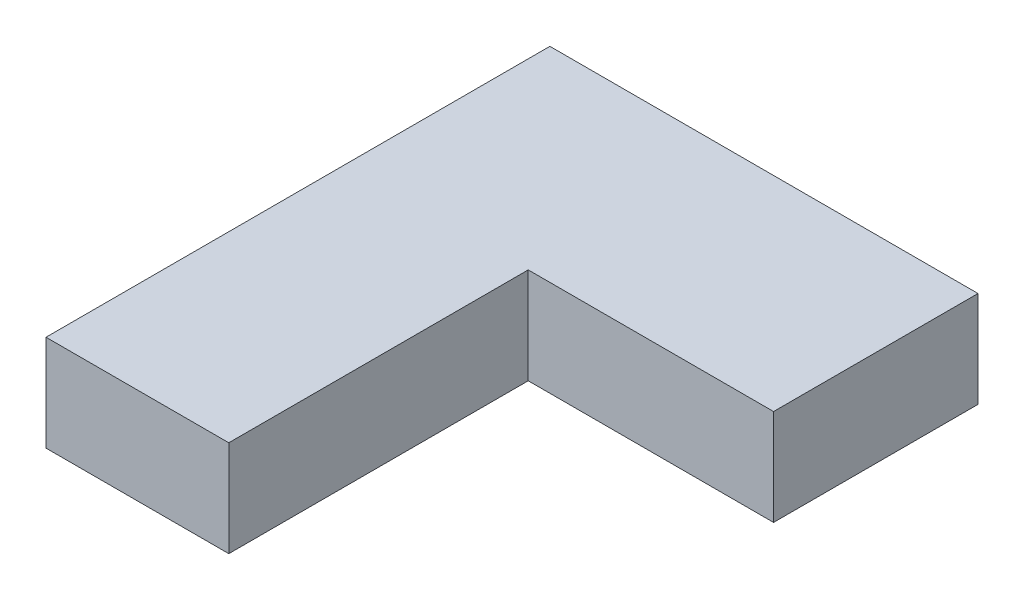
ISO-10303-21;
HEADER;
FILE_DESCRIPTION(('STEP AP214'),'2;1');
FILE_NAME('part.step','',(''),(''),'','','');
FILE_SCHEMA(('AUTOMOTIVE_DESIGN { 1 0 10303 214 1 1 1 1 }'));
ENDSEC;
DATA;
#1=APPLICATION_CONTEXT('core data for automotive mechanical design processes');
#2=APPLICATION_PROTOCOL_DEFINITION('international standard','automotive_design',2000,#1);
#3=PRODUCT_CONTEXT('',#1,'mechanical');
#4=PRODUCT('Part','Part','',(#3));
#5=PRODUCT_RELATED_PRODUCT_CATEGORY('part','',(#4));
#6=PRODUCT_DEFINITION_FORMATION('','',#4);
#7=PRODUCT_DEFINITION_CONTEXT('part definition',#1,'design');
#8=PRODUCT_DEFINITION('design','',#6,#7);
#9=PRODUCT_DEFINITION_SHAPE('','',#8);
#10=(LENGTH_UNIT() NAMED_UNIT(*) SI_UNIT(.MILLI.,.METRE.));
#11=(NAMED_UNIT(*) PLANE_ANGLE_UNIT() SI_UNIT($,.RADIAN.));
#12=(NAMED_UNIT(*) SI_UNIT($,.STERADIAN.) SOLID_ANGLE_UNIT());
#13=UNCERTAINTY_MEASURE_WITH_UNIT(LENGTH_MEASURE(1.E-05),#10,'distance_accuracy_value','');
#14=(GEOMETRIC_REPRESENTATION_CONTEXT(3) GLOBAL_UNCERTAINTY_ASSIGNED_CONTEXT((#13)) GLOBAL_UNIT_ASSIGNED_CONTEXT((#10,
#11,#12)) REPRESENTATION_CONTEXT('',''));
#15=CARTESIAN_POINT('',(0.,0.,0.));
#16=DIRECTION('',(0.,0.,1.));
#17=DIRECTION('',(1.,0.,0.));
#18=AXIS2_PLACEMENT_3D('',#15,#16,#17);
#19=CARTESIAN_POINT('',(19.0294654065861,10.,0.));
#20=DIRECTION('',(0.,0.,-1.));
#21=DIRECTION('',(-1.,0.,0.));
#22=AXIS2_PLACEMENT_3D('',#19,#20,#21);
#23=PLANE('',#22);
#24=DIRECTION('',(1.,0.,0.));
#25=VECTOR('',#24,1.);
#26=CARTESIAN_POINT('',(19.0294654065861,0.,0.));
#27=LINE('',#26,#25);
#28=CARTESIAN_POINT('',(0.,0.,0.));
#29=VERTEX_POINT('',#28);
#30=CARTESIAN_POINT('',(19.0294654065861,0.,0.));
#31=VERTEX_POINT('',#30);
#32=EDGE_CURVE('E117',#29,#31,#27,.T.);
#33=ORIENTED_EDGE('',*,*,#32,.T.);
#34=DIRECTION('',(0.,-1.,0.));
#35=VECTOR('',#34,1.);
#36=CARTESIAN_POINT('',(19.0294654065861,10.,0.));
#37=LINE('',#36,#35);
#38=CARTESIAN_POINT('',(19.0294654065861,10.,0.));
#39=VERTEX_POINT('',#38);
#40=EDGE_CURVE('E11',#39,#31,#37,.T.);
#41=ORIENTED_EDGE('',*,*,#40,.F.);
#42=DIRECTION('',(1.,0.,0.));
#43=VECTOR('',#42,1.);
#44=CARTESIAN_POINT('',(19.0294654065861,10.,0.));
#45=LINE('',#44,#43);
#46=CARTESIAN_POINT('',(0.,10.,0.));
#47=VERTEX_POINT('',#46);
#48=EDGE_CURVE('E127',#47,#39,#45,.T.);
#49=ORIENTED_EDGE('',*,*,#48,.F.);
#50=DIRECTION('',(0.,-1.,0.));
#51=VECTOR('',#50,1.);
#52=CARTESIAN_POINT('',(0.,10.,0.));
#53=LINE('',#52,#51);
#54=EDGE_CURVE('E113',#47,#29,#53,.T.);
#55=ORIENTED_EDGE('',*,*,#54,.T.);
#56=EDGE_LOOP('',(#33,#41,#49,#55));
#57=FACE_BOUND('',#56,.T.);
#58=ADVANCED_FACE('F33',(#57),#23,.F.);
#59=CARTESIAN_POINT('',(19.0294654065861,10.,-31.1732689884207));
#60=DIRECTION('',(-1.,0.,0.));
#61=DIRECTION('',(0.,0.,1.));
#62=AXIS2_PLACEMENT_3D('',#59,#60,#61);
#63=PLANE('',#62);
#64=DIRECTION('',(0.,0.,-1.));
#65=VECTOR('',#64,1.);
#66=CARTESIAN_POINT('',(19.0294654065861,0.,-31.1732689884207));
#67=LINE('',#66,#65);
#68=CARTESIAN_POINT('',(19.0294654065861,0.,-31.1732689884207));
#69=VERTEX_POINT('',#68);
#70=EDGE_CURVE('E120',#31,#69,#67,.T.);
#71=ORIENTED_EDGE('',*,*,#70,.T.);
#72=DIRECTION('',(0.,-1.,0.));
#73=VECTOR('',#72,1.);
#74=CARTESIAN_POINT('',(19.0294654065861,10.,-31.1732689884207));
#75=LINE('',#74,#73);
#76=CARTESIAN_POINT('',(19.0294654065861,10.,-31.1732689884207));
#77=VERTEX_POINT('',#76);
#78=EDGE_CURVE('E41',#77,#69,#75,.T.);
#79=ORIENTED_EDGE('',*,*,#78,.F.);
#80=DIRECTION('',(0.,0.,-1.));
#81=VECTOR('',#80,1.);
#82=CARTESIAN_POINT('',(19.0294654065861,10.,-31.1732689884207));
#83=LINE('',#82,#81);
#84=EDGE_CURVE('E86',#39,#77,#83,.T.);
#85=ORIENTED_EDGE('',*,*,#84,.F.);
#86=ORIENTED_EDGE('',*,*,#40,.T.);
#87=EDGE_LOOP('',(#71,#79,#85,#86));
#88=FACE_BOUND('',#87,.T.);
#89=ADVANCED_FACE('F151',(#88),#63,.F.);
#90=CARTESIAN_POINT('',(44.5690110838464,10.,-31.1732689884207));
#91=DIRECTION('',(0.,0.,-1.));
#92=DIRECTION('',(-1.,0.,0.));
#93=AXIS2_PLACEMENT_3D('',#90,#91,#92);
#94=PLANE('',#93);
#95=DIRECTION('',(1.,0.,0.));
#96=VECTOR('',#95,1.);
#97=CARTESIAN_POINT('',(44.5690110838464,0.,-31.1732689884207));
#98=LINE('',#97,#96);
#99=CARTESIAN_POINT('',(44.5690110838464,0.,-31.1732689884207));
#100=VERTEX_POINT('',#99);
#101=EDGE_CURVE('E122',#69,#100,#98,.T.);
#102=ORIENTED_EDGE('',*,*,#101,.T.);
#103=DIRECTION('',(0.,-1.,0.));
#104=VECTOR('',#103,1.);
#105=CARTESIAN_POINT('',(44.5690110838464,10.,-31.1732689884207));
#106=LINE('',#105,#104);
#107=CARTESIAN_POINT('',(44.5690110838464,10.,-31.1732689884207));
#108=VERTEX_POINT('',#107);
#109=EDGE_CURVE('E108',#108,#100,#106,.T.);
#110=ORIENTED_EDGE('',*,*,#109,.F.);
#111=DIRECTION('',(1.,0.,0.));
#112=VECTOR('',#111,1.);
#113=CARTESIAN_POINT('',(44.5690110838464,10.,-31.1732689884207));
#114=LINE('',#113,#112);
#115=EDGE_CURVE('E99',#77,#108,#114,.T.);
#116=ORIENTED_EDGE('',*,*,#115,.F.);
#117=ORIENTED_EDGE('',*,*,#78,.T.);
#118=EDGE_LOOP('',(#102,#110,#116,#117));
#119=FACE_BOUND('',#118,.T.);
#120=ADVANCED_FACE('F133',(#119),#94,.F.);
#121=CARTESIAN_POINT('',(44.5690110838464,10.,-52.456223719471));
#122=DIRECTION('',(-1.,0.,0.));
#123=DIRECTION('',(0.,0.,1.));
#124=AXIS2_PLACEMENT_3D('',#121,#122,#123);
#125=PLANE('',#124);
#126=DIRECTION('',(0.,0.,-1.));
#127=VECTOR('',#126,1.);
#128=CARTESIAN_POINT('',(44.5690110838464,0.,-52.456223719471));
#129=LINE('',#128,#127);
#130=CARTESIAN_POINT('',(44.5690110838464,0.,-52.456223719471));
#131=VERTEX_POINT('',#130);
#132=EDGE_CURVE('E107',#100,#131,#129,.T.);
#133=ORIENTED_EDGE('',*,*,#132,.T.);
#134=DIRECTION('',(0.,-1.,0.));
#135=VECTOR('',#134,1.);
#136=CARTESIAN_POINT('',(44.5690110838464,10.,-52.456223719471));
#137=LINE('',#136,#135);
#138=CARTESIAN_POINT('',(44.5690110838464,10.,-52.456223719471));
#139=VERTEX_POINT('',#138);
#140=EDGE_CURVE('E104',#139,#131,#137,.T.);
#141=ORIENTED_EDGE('',*,*,#140,.F.);
#142=DIRECTION('',(0.,0.,-1.));
#143=VECTOR('',#142,1.);
#144=CARTESIAN_POINT('',(44.5690110838464,10.,-52.456223719471));
#145=LINE('',#144,#143);
#146=EDGE_CURVE('E93',#108,#139,#145,.T.);
#147=ORIENTED_EDGE('',*,*,#146,.F.);
#148=ORIENTED_EDGE('',*,*,#109,.T.);
#149=EDGE_LOOP('',(#133,#141,#147,#148));
#150=FACE_BOUND('',#149,.T.);
#151=ADVANCED_FACE('F105',(#150),#125,.F.);
#152=CARTESIAN_POINT('',(0.,10.,-52.456223719471));
#153=DIRECTION('',(0.,0.,1.));
#154=DIRECTION('',(1.,0.,0.));
#155=AXIS2_PLACEMENT_3D('',#152,#153,#154);
#156=PLANE('',#155);
#157=DIRECTION('',(-1.,0.,0.));
#158=VECTOR('',#157,1.);
#159=CARTESIAN_POINT('',(0.,0.,-52.456223719471));
#160=LINE('',#159,#158);
#161=CARTESIAN_POINT('',(0.,0.,-52.456223719471));
#162=VERTEX_POINT('',#161);
#163=EDGE_CURVE('E72',#131,#162,#160,.T.);
#164=ORIENTED_EDGE('',*,*,#163,.T.);
#165=DIRECTION('',(0.,-1.,0.));
#166=VECTOR('',#165,1.);
#167=CARTESIAN_POINT('',(0.,10.,-52.456223719471));
#168=LINE('',#167,#166);
#169=CARTESIAN_POINT('',(0.,10.,-52.456223719471));
#170=VERTEX_POINT('',#169);
#171=EDGE_CURVE('E109',#170,#162,#168,.T.);
#172=ORIENTED_EDGE('',*,*,#171,.F.);
#173=DIRECTION('',(-1.,0.,0.));
#174=VECTOR('',#173,1.);
#175=CARTESIAN_POINT('',(0.,10.,-52.456223719471));
#176=LINE('',#175,#174);
#177=EDGE_CURVE('E97',#139,#170,#176,.T.);
#178=ORIENTED_EDGE('',*,*,#177,.F.);
#179=ORIENTED_EDGE('',*,*,#140,.T.);
#180=EDGE_LOOP('',(#164,#172,#178,#179));
#181=FACE_BOUND('',#180,.T.);
#182=ADVANCED_FACE('F111',(#181),#156,.F.);
#183=CARTESIAN_POINT('',(0.,10.,0.));
#184=DIRECTION('',(1.,0.,0.));
#185=DIRECTION('',(0.,0.,-1.));
#186=AXIS2_PLACEMENT_3D('',#183,#184,#185);
#187=PLANE('',#186);
#188=DIRECTION('',(0.,0.,1.));
#189=VECTOR('',#188,1.);
#190=CARTESIAN_POINT('',(0.,0.,0.));
#191=LINE('',#190,#189);
#192=EDGE_CURVE('E78',#162,#29,#191,.T.);
#193=ORIENTED_EDGE('',*,*,#192,.T.);
#194=ORIENTED_EDGE('',*,*,#54,.F.);
#195=DIRECTION('',(0.,0.,1.));
#196=VECTOR('',#195,1.);
#197=CARTESIAN_POINT('',(0.,10.,0.));
#198=LINE('',#197,#196);
#199=EDGE_CURVE('E49',#170,#47,#198,.T.);
#200=ORIENTED_EDGE('',*,*,#199,.F.);
#201=ORIENTED_EDGE('',*,*,#171,.T.);
#202=EDGE_LOOP('',(#193,#194,#200,#201));
#203=FACE_BOUND('',#202,.T.);
#204=ADVANCED_FACE('F140',(#203),#187,.F.);
#205=CARTESIAN_POINT('',(0.,10.,0.));
#206=DIRECTION('',(0.,-1.,0.));
#207=DIRECTION('',(0.,0.,-1.));
#208=AXIS2_PLACEMENT_3D('',#205,#206,#207);
#209=PLANE('',#208);
#210=ORIENTED_EDGE('',*,*,#48,.T.);
#211=ORIENTED_EDGE('',*,*,#84,.T.);
#212=ORIENTED_EDGE('',*,*,#115,.T.);
#213=ORIENTED_EDGE('',*,*,#146,.T.);
#214=ORIENTED_EDGE('',*,*,#177,.T.);
#215=ORIENTED_EDGE('',*,*,#199,.T.);
#216=EDGE_LOOP('',(#210,#211,#212,#213,#214,#215));
#217=FACE_BOUND('',#216,.T.);
#218=ADVANCED_FACE('F95',(#217),#209,.F.);
#219=CARTESIAN_POINT('',(0.,0.,0.));
#220=DIRECTION('',(0.,-1.,0.));
#221=DIRECTION('',(0.,0.,-1.));
#222=AXIS2_PLACEMENT_3D('',#219,#220,#221);
#223=PLANE('',#222);
#224=ORIENTED_EDGE('',*,*,#32,.F.);
#225=ORIENTED_EDGE('',*,*,#192,.F.);
#226=ORIENTED_EDGE('',*,*,#163,.F.);
#227=ORIENTED_EDGE('',*,*,#132,.F.);
#228=ORIENTED_EDGE('',*,*,#101,.F.);
#229=ORIENTED_EDGE('',*,*,#70,.F.);
#230=EDGE_LOOP('',(#224,#225,#226,#227,#228,#229));
#231=FACE_BOUND('',#230,.T.);
#232=ADVANCED_FACE('F136',(#231),#223,.T.);
#233=CLOSED_SHELL('',(#58,#89,#120,#151,#182,#204,#218,#232));
#234=MANIFOLD_SOLID_BREP('B2',#233);
#235=ADVANCED_BREP_SHAPE_REPRESENTATION('',(#18,#234),#14);
#236=SHAPE_DEFINITION_REPRESENTATION(#9,#235);
ENDSEC;
END-ISO-10303-21;
